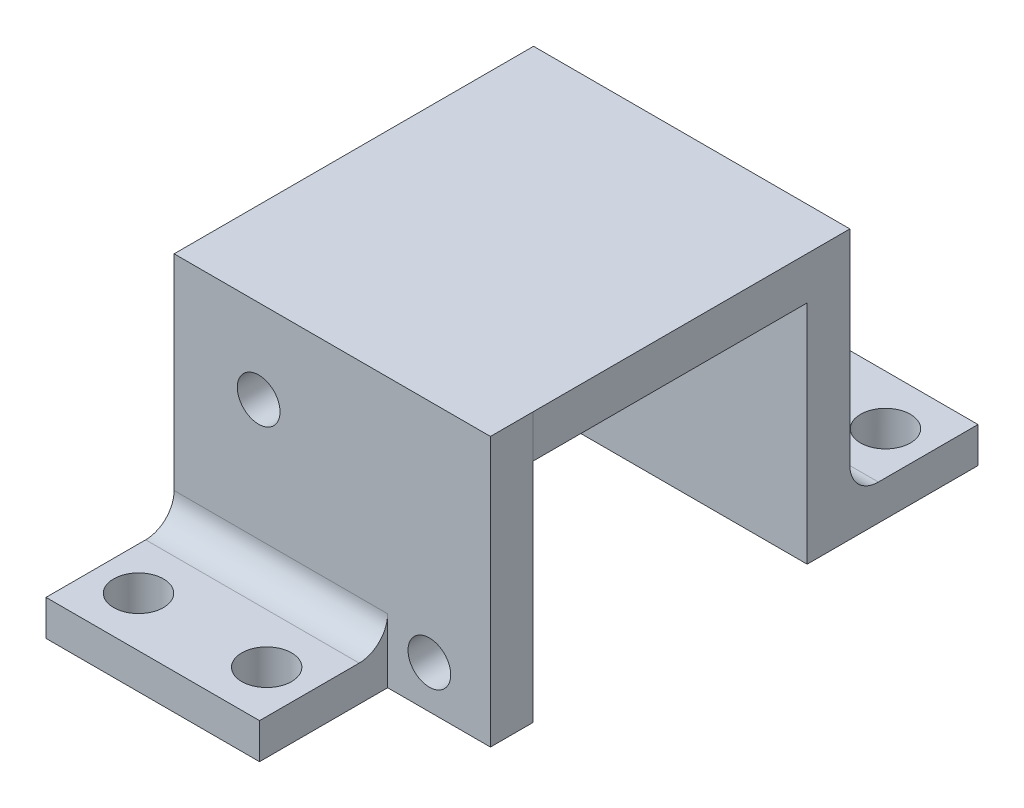
ISO-10303-21;
HEADER;
FILE_DESCRIPTION(('STEP AP214'),'2;1');
FILE_NAME('part.step','',(''),(''),'','','');
FILE_SCHEMA(('AUTOMOTIVE_DESIGN { 1 0 10303 214 1 1 1 1 }'));
ENDSEC;
DATA;
#1=APPLICATION_CONTEXT('core data for automotive mechanical design processes');
#2=APPLICATION_PROTOCOL_DEFINITION('international standard','automotive_design',2000,#1);
#3=PRODUCT_CONTEXT('',#1,'mechanical');
#4=PRODUCT('Part','Part','',(#3));
#5=PRODUCT_RELATED_PRODUCT_CATEGORY('part','',(#4));
#6=PRODUCT_DEFINITION_FORMATION('','',#4);
#7=PRODUCT_DEFINITION_CONTEXT('part definition',#1,'design');
#8=PRODUCT_DEFINITION('design','',#6,#7);
#9=PRODUCT_DEFINITION_SHAPE('','',#8);
#10=(LENGTH_UNIT() NAMED_UNIT(*) SI_UNIT(.MILLI.,.METRE.));
#11=(NAMED_UNIT(*) PLANE_ANGLE_UNIT() SI_UNIT($,.RADIAN.));
#12=(NAMED_UNIT(*) SI_UNIT($,.STERADIAN.) SOLID_ANGLE_UNIT());
#13=UNCERTAINTY_MEASURE_WITH_UNIT(LENGTH_MEASURE(1.E-05),#10,'distance_accuracy_value','');
#14=(GEOMETRIC_REPRESENTATION_CONTEXT(3) GLOBAL_UNCERTAINTY_ASSIGNED_CONTEXT((#13)) GLOBAL_UNIT_ASSIGNED_CONTEXT((#10,
#11,#12)) REPRESENTATION_CONTEXT('',''));
#15=CARTESIAN_POINT('',(0.,0.,0.));
#16=DIRECTION('',(0.,0.,1.));
#17=DIRECTION('',(1.,0.,0.));
#18=AXIS2_PLACEMENT_3D('',#15,#16,#17);
#19=CARTESIAN_POINT('',(0.,0.,0.));
#20=DIRECTION('',(0.,0.,1.));
#21=DIRECTION('',(1.,0.,0.));
#22=AXIS2_PLACEMENT_3D('',#19,#20,#21);
#23=PLANE('',#22);
#24=CARTESIAN_POINT('',(6.82,-4.95,0.));
#25=DIRECTION('',(0.,0.,1.));
#26=DIRECTION('',(1.,0.,0.));
#27=AXIS2_PLACEMENT_3D('',#24,#25,#26);
#28=CIRCLE('',#27,1.5);
#29=CARTESIAN_POINT('',(8.32,-4.95,0.));
#30=VERTEX_POINT('',#29);
#31=EDGE_CURVE('E419',#30,#30,#28,.T.);
#32=ORIENTED_EDGE('',*,*,#31,.T.);
#33=EDGE_LOOP('',(#32));
#34=FACE_BOUND('',#33,.T.);
#35=CARTESIAN_POINT('',(-5.17,5.05,0.));
#36=DIRECTION('',(0.,0.,1.));
#37=DIRECTION('',(1.,0.,0.));
#38=AXIS2_PLACEMENT_3D('',#35,#36,#37);
#39=CIRCLE('',#38,1.5);
#40=CARTESIAN_POINT('',(-3.67,5.05,0.));
#41=VERTEX_POINT('',#40);
#42=EDGE_CURVE('E412',#41,#41,#39,.T.);
#43=ORIENTED_EDGE('',*,*,#42,.T.);
#44=EDGE_LOOP('',(#43));
#45=FACE_BOUND('',#44,.T.);
#46=DIRECTION('',(-1.,0.,0.));
#47=VECTOR('',#46,1.);
#48=CARTESIAN_POINT('',(11.1100249999999,7.95,1.55161605272255E-13));
#49=LINE('',#48,#47);
#50=CARTESIAN_POINT('',(11.11,7.95,0.));
#51=VERTEX_POINT('',#50);
#52=CARTESIAN_POINT('',(-11.1099875,7.95,0.));
#53=VERTEX_POINT('',#52);
#54=EDGE_CURVE('E11',#51,#53,#49,.T.);
#55=ORIENTED_EDGE('',*,*,#54,.F.);
#56=DIRECTION('',(0.,1.,0.));
#57=VECTOR('',#56,1.);
#58=CARTESIAN_POINT('',(11.11,7.95,0.));
#59=LINE('',#58,#57);
#60=CARTESIAN_POINT('',(11.11,-7.95,0.));
#61=VERTEX_POINT('',#60);
#62=EDGE_CURVE('E277',#61,#51,#59,.T.);
#63=ORIENTED_EDGE('',*,*,#62,.F.);
#64=DIRECTION('',(1.,0.,0.));
#65=VECTOR('',#64,1.);
#66=CARTESIAN_POINT('',(-11.11,-7.95,0.));
#67=LINE('',#66,#65);
#68=CARTESIAN_POINT('',(-11.11,-7.95,0.));
#69=VERTEX_POINT('',#68);
#70=EDGE_CURVE('E276',#69,#61,#67,.T.);
#71=ORIENTED_EDGE('',*,*,#70,.F.);
#72=DIRECTION('',(0.,-1.,0.));
#73=VECTOR('',#72,1.);
#74=CARTESIAN_POINT('',(-11.11,7.95,0.));
#75=LINE('',#74,#73);
#76=EDGE_CURVE('E269',#53,#69,#75,.T.);
#77=ORIENTED_EDGE('',*,*,#76,.F.);
#78=EDGE_LOOP('',(#55,#63,#71,#77));
#79=FACE_BOUND('',#78,.T.);
#80=ADVANCED_FACE('F32',(#34,#45,#79),#23,.F.);
#81=CARTESIAN_POINT('',(0.,0.,3.));
#82=DIRECTION('',(0.,0.,1.));
#83=DIRECTION('',(1.,0.,0.));
#84=AXIS2_PLACEMENT_3D('',#81,#82,#83);
#85=PLANE('',#84);
#86=DIRECTION('',(0.,-1.,0.));
#87=VECTOR('',#86,1.);
#88=CARTESIAN_POINT('',(-11.11,7.95,3.));
#89=LINE('',#88,#87);
#90=CARTESIAN_POINT('',(-11.1099875000001,7.95,3.));
#91=VERTEX_POINT('',#90);
#92=CARTESIAN_POINT('',(-11.11,-3.44999999999999,3.));
#93=VERTEX_POINT('',#92);
#94=EDGE_CURVE('E423',#91,#93,#89,.T.);
#95=ORIENTED_EDGE('',*,*,#94,.T.);
#96=DIRECTION('',(-1.,0.,0.));
#97=VECTOR('',#96,1.);
#98=CARTESIAN_POINT('',(3.89,-3.44999999999999,3.));
#99=LINE('',#98,#97);
#100=CARTESIAN_POINT('',(3.89,-3.44999999999999,3.));
#101=VERTEX_POINT('',#100);
#102=EDGE_CURVE('E506',#93,#101,#99,.F.);
#103=ORIENTED_EDGE('',*,*,#102,.T.);
#104=DIRECTION('',(0.,-1.,0.));
#105=VECTOR('',#104,1.);
#106=CARTESIAN_POINT('',(3.89,-5.44999999999999,3.));
#107=LINE('',#106,#105);
#108=CARTESIAN_POINT('',(3.89,-7.95,3.));
#109=VERTEX_POINT('',#108);
#110=EDGE_CURVE('E55',#101,#109,#107,.T.);
#111=ORIENTED_EDGE('',*,*,#110,.T.);
#112=DIRECTION('',(1.,0.,0.));
#113=VECTOR('',#112,1.);
#114=CARTESIAN_POINT('',(-11.11,-7.95,3.));
#115=LINE('',#114,#113);
#116=CARTESIAN_POINT('',(11.11,-7.95,3.));
#117=VERTEX_POINT('',#116);
#118=EDGE_CURVE('E431',#109,#117,#115,.T.);
#119=ORIENTED_EDGE('',*,*,#118,.T.);
#120=DIRECTION('',(0.,1.,0.));
#121=VECTOR('',#120,1.);
#122=CARTESIAN_POINT('',(11.11,7.95,3.));
#123=LINE('',#122,#121);
#124=CARTESIAN_POINT('',(11.11,10.95,3.00000000000016));
#125=VERTEX_POINT('',#124);
#126=EDGE_CURVE('E409',#117,#125,#123,.T.);
#127=ORIENTED_EDGE('',*,*,#126,.T.);
#128=DIRECTION('',(-1.,0.,0.));
#129=VECTOR('',#128,1.);
#130=CARTESIAN_POINT('',(11.11,10.95,3.00000000000016));
#131=LINE('',#130,#129);
#132=CARTESIAN_POINT('',(-11.1099750000001,10.95,3.));
#133=VERTEX_POINT('',#132);
#134=EDGE_CURVE('E189',#125,#133,#131,.T.);
#135=ORIENTED_EDGE('',*,*,#134,.T.);
#136=DIRECTION('',(0.,1.,0.));
#137=VECTOR('',#136,1.);
#138=CARTESIAN_POINT('',(-11.1099750000001,7.95,3.));
#139=LINE('',#138,#137);
#140=EDGE_CURVE('E188',#91,#133,#139,.T.);
#141=ORIENTED_EDGE('',*,*,#140,.F.);
#142=EDGE_LOOP('',(#95,#103,#111,#119,#127,#135,#141));
#143=FACE_BOUND('',#142,.T.);
#144=CARTESIAN_POINT('',(-5.17,5.05,3.));
#145=DIRECTION('',(0.,0.,1.));
#146=DIRECTION('',(1.,0.,0.));
#147=AXIS2_PLACEMENT_3D('',#144,#145,#146);
#148=CIRCLE('',#147,1.5);
#149=CARTESIAN_POINT('',(-3.67,5.05,3.));
#150=VERTEX_POINT('',#149);
#151=EDGE_CURVE('E410',#150,#150,#148,.T.);
#152=ORIENTED_EDGE('',*,*,#151,.F.);
#153=EDGE_LOOP('',(#152));
#154=FACE_BOUND('',#153,.T.);
#155=CARTESIAN_POINT('',(6.82,-4.95,3.));
#156=DIRECTION('',(0.,0.,1.));
#157=DIRECTION('',(1.,0.,0.));
#158=AXIS2_PLACEMENT_3D('',#155,#156,#157);
#159=CIRCLE('',#158,1.5);
#160=CARTESIAN_POINT('',(8.32,-4.95,3.));
#161=VERTEX_POINT('',#160);
#162=EDGE_CURVE('E416',#161,#161,#159,.T.);
#163=ORIENTED_EDGE('',*,*,#162,.F.);
#164=EDGE_LOOP('',(#163));
#165=FACE_BOUND('',#164,.T.);
#166=ADVANCED_FACE('F248',(#143,#154,#165),#85,.T.);
#167=CARTESIAN_POINT('',(11.11,7.95,3.));
#168=DIRECTION('',(-1.,0.,0.));
#169=DIRECTION('',(0.,-1.,0.));
#170=AXIS2_PLACEMENT_3D('',#167,#168,#169);
#171=PLANE('',#170);
#172=ORIENTED_EDGE('',*,*,#62,.T.);
#173=CARTESIAN_POINT('',(11.11,10.95,0.));
#174=VERTEX_POINT('',#173);
#175=EDGE_CURVE('E171',#51,#174,#59,.T.);
#176=ORIENTED_EDGE('',*,*,#175,.T.);
#177=DIRECTION('',(0.,0.,-1.));
#178=VECTOR('',#177,1.);
#179=CARTESIAN_POINT('',(11.11,10.95,3.00000000000016));
#180=LINE('',#179,#178);
#181=EDGE_CURVE('E187',#125,#174,#180,.T.);
#182=ORIENTED_EDGE('',*,*,#181,.F.);
#183=ORIENTED_EDGE('',*,*,#126,.F.);
#184=DIRECTION('',(0.,0.,-1.));
#185=VECTOR('',#184,1.);
#186=CARTESIAN_POINT('',(11.11,-7.95,3.));
#187=LINE('',#186,#185);
#188=EDGE_CURVE('E435',#117,#61,#187,.T.);
#189=ORIENTED_EDGE('',*,*,#188,.T.);
#190=EDGE_LOOP('',(#172,#176,#182,#183,#189));
#191=FACE_BOUND('',#190,.T.);
#192=ADVANCED_FACE('F251',(#191),#171,.F.);
#193=CARTESIAN_POINT('',(-11.11,7.95,3.));
#194=DIRECTION('',(1.,0.,0.));
#195=DIRECTION('',(0.,1.,0.));
#196=AXIS2_PLACEMENT_3D('',#193,#194,#195);
#197=PLANE('',#196);
#198=ORIENTED_EDGE('',*,*,#76,.T.);
#199=DIRECTION('',(0.,0.,-1.));
#200=VECTOR('',#199,1.);
#201=CARTESIAN_POINT('',(-11.11,-7.95,3.));
#202=LINE('',#201,#200);
#203=CARTESIAN_POINT('',(-11.11,-7.95,12.));
#204=VERTEX_POINT('',#203);
#205=EDGE_CURVE('E432',#204,#69,#202,.T.);
#206=ORIENTED_EDGE('',*,*,#205,.F.);
#207=DIRECTION('',(0.,1.,0.));
#208=VECTOR('',#207,1.);
#209=CARTESIAN_POINT('',(-11.11,-5.45,12.));
#210=LINE('',#209,#208);
#211=CARTESIAN_POINT('',(-11.11,-5.45,12.));
#212=VERTEX_POINT('',#211);
#213=EDGE_CURVE('E451',#204,#212,#210,.T.);
#214=ORIENTED_EDGE('',*,*,#213,.T.);
#215=DIRECTION('',(0.,0.,-1.));
#216=VECTOR('',#215,1.);
#217=CARTESIAN_POINT('',(-11.11,-5.45,12.));
#218=LINE('',#217,#216);
#219=CARTESIAN_POINT('',(-11.11,-5.45,5.));
#220=VERTEX_POINT('',#219);
#221=EDGE_CURVE('E445',#212,#220,#218,.T.);
#222=ORIENTED_EDGE('',*,*,#221,.T.);
#223=CARTESIAN_POINT('',(-11.11,-3.45,5.));
#224=DIRECTION('',(1.,0.,0.));
#225=DIRECTION('',(0.,1.,0.));
#226=AXIS2_PLACEMENT_3D('',#223,#224,#225);
#227=CIRCLE('',#226,2.);
#228=EDGE_CURVE('E505',#220,#93,#227,.T.);
#229=ORIENTED_EDGE('',*,*,#228,.T.);
#230=ORIENTED_EDGE('',*,*,#94,.F.);
#231=CARTESIAN_POINT('',(-11.11,7.95,3.));
#232=DIRECTION('',(0.,0.,-1.));
#233=VECTOR('',#232,1.);
#234=LINE('',#231,#233);
#235=EDGE_CURVE('E198',#91,#53,#234,.T.);
#236=ORIENTED_EDGE('',*,*,#235,.T.);
#237=EDGE_LOOP('',(#198,#206,#214,#222,#229,#230,#236));
#238=FACE_BOUND('',#237,.T.);
#239=ADVANCED_FACE('F258',(#238),#197,.F.);
#240=CARTESIAN_POINT('',(-11.11,-7.95,3.));
#241=DIRECTION('',(0.,1.,0.));
#242=DIRECTION('',(0.,0.,1.));
#243=AXIS2_PLACEMENT_3D('',#240,#241,#242);
#244=PLANE('',#243);
#245=CARTESIAN_POINT('',(0.890000000000004,-7.95,8.5));
#246=DIRECTION('',(0.,1.,0.));
#247=DIRECTION('',(0.,0.,1.));
#248=AXIS2_PLACEMENT_3D('',#245,#246,#247);
#249=CIRCLE('',#248,1.75);
#250=CARTESIAN_POINT('',(0.890000000000004,-7.95,10.25));
#251=VERTEX_POINT('',#250);
#252=EDGE_CURVE('E489',#251,#251,#249,.F.);
#253=ORIENTED_EDGE('',*,*,#252,.F.);
#254=EDGE_LOOP('',(#253));
#255=FACE_BOUND('',#254,.T.);
#256=CARTESIAN_POINT('',(-8.11,-7.95,8.5));
#257=DIRECTION('',(0.,1.,0.));
#258=DIRECTION('',(0.,0.,1.));
#259=AXIS2_PLACEMENT_3D('',#256,#257,#258);
#260=CIRCLE('',#259,1.75);
#261=CARTESIAN_POINT('',(-8.11,-7.95,10.25));
#262=VERTEX_POINT('',#261);
#263=EDGE_CURVE('E454',#262,#262,#260,.F.);
#264=ORIENTED_EDGE('',*,*,#263,.F.);
#265=EDGE_LOOP('',(#264));
#266=FACE_BOUND('',#265,.T.);
#267=ORIENTED_EDGE('',*,*,#70,.T.);
#268=ORIENTED_EDGE('',*,*,#188,.F.);
#269=ORIENTED_EDGE('',*,*,#118,.F.);
#270=DIRECTION('',(0.,0.,1.));
#271=VECTOR('',#270,1.);
#272=CARTESIAN_POINT('',(3.89,-7.94999999999999,12.));
#273=LINE('',#272,#271);
#274=CARTESIAN_POINT('',(3.89,-7.94999999999999,12.));
#275=VERTEX_POINT('',#274);
#276=EDGE_CURVE('E436',#109,#275,#273,.T.);
#277=ORIENTED_EDGE('',*,*,#276,.T.);
#278=DIRECTION('',(-1.,0.,0.));
#279=VECTOR('',#278,1.);
#280=CARTESIAN_POINT('',(3.89,-7.94999999999999,12.));
#281=LINE('',#280,#279);
#282=EDGE_CURVE('E455',#275,#204,#281,.T.);
#283=ORIENTED_EDGE('',*,*,#282,.T.);
#284=ORIENTED_EDGE('',*,*,#205,.T.);
#285=EDGE_LOOP('',(#267,#268,#269,#277,#283,#284));
#286=FACE_BOUND('',#285,.T.);
#287=ADVANCED_FACE('F246',(#255,#266,#286),#244,.F.);
#288=CARTESIAN_POINT('',(-5.17,5.05,3.));
#289=DIRECTION('',(0.,0.,-1.));
#290=DIRECTION('',(-1.,0.,0.));
#291=AXIS2_PLACEMENT_3D('',#288,#289,#290);
#292=CYLINDRICAL_SURFACE('',#291,1.5);
#293=ORIENTED_EDGE('',*,*,#151,.T.);
#294=EDGE_LOOP('',(#293));
#295=FACE_BOUND('',#294,.T.);
#296=ORIENTED_EDGE('',*,*,#42,.F.);
#297=EDGE_LOOP('',(#296));
#298=FACE_BOUND('',#297,.T.);
#299=ADVANCED_FACE('F242',(#295,#298),#292,.F.);
#300=CARTESIAN_POINT('',(6.82,-4.95,3.));
#301=DIRECTION('',(0.,0.,-1.));
#302=DIRECTION('',(-1.,0.,0.));
#303=AXIS2_PLACEMENT_3D('',#300,#301,#302);
#304=CYLINDRICAL_SURFACE('',#303,1.5);
#305=ORIENTED_EDGE('',*,*,#162,.T.);
#306=EDGE_LOOP('',(#305));
#307=FACE_BOUND('',#306,.T.);
#308=ORIENTED_EDGE('',*,*,#31,.F.);
#309=EDGE_LOOP('',(#308));
#310=FACE_BOUND('',#309,.T.);
#311=ADVANCED_FACE('F238',(#307,#310),#304,.F.);
#312=CARTESIAN_POINT('',(3.89,-5.44999999999999,12.));
#313=DIRECTION('',(0.,0.,1.));
#314=DIRECTION('',(1.,0.,0.));
#315=AXIS2_PLACEMENT_3D('',#312,#313,#314);
#316=PLANE('',#315);
#317=ORIENTED_EDGE('',*,*,#213,.F.);
#318=ORIENTED_EDGE('',*,*,#282,.F.);
#319=DIRECTION('',(0.,1.,0.));
#320=VECTOR('',#319,1.);
#321=CARTESIAN_POINT('',(3.89,-5.44999999999999,12.));
#322=LINE('',#321,#320);
#323=CARTESIAN_POINT('',(3.89,-5.44999999999999,12.));
#324=VERTEX_POINT('',#323);
#325=EDGE_CURVE('E471',#275,#324,#322,.T.);
#326=ORIENTED_EDGE('',*,*,#325,.T.);
#327=DIRECTION('',(-1.,0.,0.));
#328=VECTOR('',#327,1.);
#329=CARTESIAN_POINT('',(3.89,-5.44999999999999,12.));
#330=LINE('',#329,#328);
#331=EDGE_CURVE('E439',#324,#212,#330,.T.);
#332=ORIENTED_EDGE('',*,*,#331,.T.);
#333=EDGE_LOOP('',(#317,#318,#326,#332));
#334=FACE_BOUND('',#333,.T.);
#335=ADVANCED_FACE('F234',(#334),#316,.T.);
#336=CARTESIAN_POINT('',(3.89,-5.44999999999999,12.));
#337=DIRECTION('',(0.,1.,0.));
#338=DIRECTION('',(-1.,0.,0.));
#339=AXIS2_PLACEMENT_3D('',#336,#337,#338);
#340=PLANE('',#339);
#341=CARTESIAN_POINT('',(0.890000000000004,-5.44999999999999,8.5));
#342=DIRECTION('',(0.,1.,0.));
#343=DIRECTION('',(1.,0.,0.));
#344=AXIS2_PLACEMENT_3D('',#341,#342,#343);
#345=CIRCLE('',#344,1.75);
#346=CARTESIAN_POINT('',(2.64,-5.44999999999999,8.5));
#347=VERTEX_POINT('',#346);
#348=EDGE_CURVE('E191',#347,#347,#345,.T.);
#349=ORIENTED_EDGE('',*,*,#348,.F.);
#350=EDGE_LOOP('',(#349));
#351=FACE_BOUND('',#350,.T.);
#352=CARTESIAN_POINT('',(-8.11,-5.44999999999999,8.5));
#353=DIRECTION('',(0.,1.,0.));
#354=DIRECTION('',(-1.,0.,0.));
#355=AXIS2_PLACEMENT_3D('',#352,#353,#354);
#356=CIRCLE('',#355,1.75);
#357=CARTESIAN_POINT('',(-9.86,-5.44999999999999,8.5));
#358=VERTEX_POINT('',#357);
#359=EDGE_CURVE('E486',#358,#358,#356,.T.);
#360=ORIENTED_EDGE('',*,*,#359,.F.);
#361=EDGE_LOOP('',(#360));
#362=FACE_BOUND('',#361,.T.);
#363=DIRECTION('',(0.,0.,-1.));
#364=VECTOR('',#363,1.);
#365=CARTESIAN_POINT('',(3.89,-5.44999999999999,12.));
#366=LINE('',#365,#364);
#367=CARTESIAN_POINT('',(3.89,-5.44999999999999,5.));
#368=VERTEX_POINT('',#367);
#369=EDGE_CURVE('E444',#324,#368,#366,.T.);
#370=ORIENTED_EDGE('',*,*,#369,.T.);
#371=DIRECTION('',(-1.,0.,0.));
#372=VECTOR('',#371,1.);
#373=CARTESIAN_POINT('',(-11.11,-5.45,5.));
#374=LINE('',#373,#372);
#375=EDGE_CURVE('E478',#368,#220,#374,.T.);
#376=ORIENTED_EDGE('',*,*,#375,.T.);
#377=ORIENTED_EDGE('',*,*,#221,.F.);
#378=ORIENTED_EDGE('',*,*,#331,.F.);
#379=EDGE_LOOP('',(#370,#376,#377,#378));
#380=FACE_BOUND('',#379,.T.);
#381=ADVANCED_FACE('F231',(#351,#362,#380),#340,.T.);
#382=CARTESIAN_POINT('',(3.89,0.,0.));
#383=DIRECTION('',(1.,0.,0.));
#384=DIRECTION('',(0.,0.,-1.));
#385=AXIS2_PLACEMENT_3D('',#382,#383,#384);
#386=PLANE('',#385);
#387=ORIENTED_EDGE('',*,*,#325,.F.);
#388=ORIENTED_EDGE('',*,*,#276,.F.);
#389=ORIENTED_EDGE('',*,*,#110,.F.);
#390=CARTESIAN_POINT('',(3.89,-3.44999999999999,5.));
#391=DIRECTION('',(1.,0.,0.));
#392=DIRECTION('',(0.,0.,-1.));
#393=AXIS2_PLACEMENT_3D('',#390,#391,#392);
#394=CIRCLE('',#393,2.);
#395=EDGE_CURVE('E41',#101,#368,#394,.F.);
#396=ORIENTED_EDGE('',*,*,#395,.T.);
#397=ORIENTED_EDGE('',*,*,#369,.F.);
#398=EDGE_LOOP('',(#387,#388,#389,#396,#397));
#399=FACE_BOUND('',#398,.T.);
#400=ADVANCED_FACE('F228',(#399),#386,.T.);
#401=CARTESIAN_POINT('',(3.89,-3.44999999999999,5.));
#402=DIRECTION('',(1.,0.,0.));
#403=DIRECTION('',(0.,1.,0.));
#404=AXIS2_PLACEMENT_3D('',#401,#402,#403);
#405=CYLINDRICAL_SURFACE('',#404,2.);
#406=ORIENTED_EDGE('',*,*,#395,.F.);
#407=ORIENTED_EDGE('',*,*,#102,.F.);
#408=ORIENTED_EDGE('',*,*,#228,.F.);
#409=ORIENTED_EDGE('',*,*,#375,.F.);
#410=EDGE_LOOP('',(#406,#407,#408,#409));
#411=FACE_BOUND('',#410,.T.);
#412=ADVANCED_FACE('F34',(#411),#405,.F.);
#413=CARTESIAN_POINT('',(-8.11,-7.95105,8.5));
#414=DIRECTION('',(0.,1.,0.));
#415=DIRECTION('',(-1.,0.,0.));
#416=AXIS2_PLACEMENT_3D('',#413,#414,#415);
#417=CYLINDRICAL_SURFACE('',#416,1.75);
#418=ORIENTED_EDGE('',*,*,#359,.T.);
#419=EDGE_LOOP('',(#418));
#420=FACE_BOUND('',#419,.T.);
#421=ORIENTED_EDGE('',*,*,#263,.T.);
#422=EDGE_LOOP('',(#421));
#423=FACE_BOUND('',#422,.T.);
#424=ADVANCED_FACE('F223',(#420,#423),#417,.F.);
#425=CARTESIAN_POINT('',(0.890000000000004,-7.95105,8.5));
#426=DIRECTION('',(0.,1.,0.));
#427=DIRECTION('',(-1.,0.,0.));
#428=AXIS2_PLACEMENT_3D('',#425,#426,#427);
#429=CYLINDRICAL_SURFACE('',#428,1.75);
#430=ORIENTED_EDGE('',*,*,#348,.T.);
#431=EDGE_LOOP('',(#430));
#432=FACE_BOUND('',#431,.T.);
#433=ORIENTED_EDGE('',*,*,#252,.T.);
#434=EDGE_LOOP('',(#433));
#435=FACE_BOUND('',#434,.T.);
#436=ADVANCED_FACE('F219',(#432,#435),#429,.F.);
#437=CARTESIAN_POINT('',(11.11,10.95,3.00000000000016));
#438=DIRECTION('',(0.,1.,0.));
#439=DIRECTION('',(-1.,0.,0.));
#440=AXIS2_PLACEMENT_3D('',#437,#438,#439);
#441=PLANE('',#440);
#442=DIRECTION('',(0.,0.,-1.));
#443=VECTOR('',#442,1.);
#444=CARTESIAN_POINT('',(-11.1099750000001,10.95,3.));
#445=LINE('',#444,#443);
#446=CARTESIAN_POINT('',(-11.1099749999999,10.95,-22.2499750000001));
#447=VERTEX_POINT('',#446);
#448=EDGE_CURVE('E185',#133,#447,#445,.T.);
#449=ORIENTED_EDGE('',*,*,#448,.F.);
#450=ORIENTED_EDGE('',*,*,#134,.F.);
#451=ORIENTED_EDGE('',*,*,#181,.T.);
#452=DIRECTION('',(0.,0.,-1.));
#453=VECTOR('',#452,1.);
#454=CARTESIAN_POINT('',(11.1100249999999,10.95,0.));
#455=LINE('',#454,#453);
#456=CARTESIAN_POINT('',(11.1100250000001,10.95,-22.2499749999999));
#457=VERTEX_POINT('',#456);
#458=EDGE_CURVE('E173',#174,#457,#455,.T.);
#459=ORIENTED_EDGE('',*,*,#458,.T.);
#460=DIRECTION('',(-1.,0.,0.));
#461=VECTOR('',#460,1.);
#462=CARTESIAN_POINT('',(11.1100250000001,10.95,-22.2499749999999));
#463=LINE('',#462,#461);
#464=EDGE_CURVE('E172',#457,#447,#463,.T.);
#465=ORIENTED_EDGE('',*,*,#464,.T.);
#466=EDGE_LOOP('',(#449,#450,#451,#459,#465));
#467=FACE_BOUND('',#466,.T.);
#468=ADVANCED_FACE('F214',(#467),#441,.T.);
#469=CARTESIAN_POINT('',(-11.1099750000001,0.,0.));
#470=DIRECTION('',(-1.,0.,0.));
#471=DIRECTION('',(0.,0.,1.));
#472=AXIS2_PLACEMENT_3D('',#469,#470,#471);
#473=PLANE('',#472);
#474=ORIENTED_EDGE('',*,*,#448,.T.);
#475=DIRECTION('',(0.,1.,0.));
#476=VECTOR('',#475,1.);
#477=CARTESIAN_POINT('',(-11.1099749999999,7.95,-22.2499750000001));
#478=LINE('',#477,#476);
#479=CARTESIAN_POINT('',(-11.1099749999999,-7.95,-22.2499750000001));
#480=VERTEX_POINT('',#479);
#481=EDGE_CURVE('E350',#480,#447,#478,.T.);
#482=ORIENTED_EDGE('',*,*,#481,.F.);
#483=DIRECTION('',(0.,0.,1.));
#484=VECTOR('',#483,1.);
#485=CARTESIAN_POINT('',(-11.1099749999999,-7.95,-22.2499750000001));
#486=LINE('',#485,#484);
#487=CARTESIAN_POINT('',(-11.109975,-7.95,-19.2499750000001));
#488=VERTEX_POINT('',#487);
#489=EDGE_CURVE('E351',#480,#488,#486,.T.);
#490=ORIENTED_EDGE('',*,*,#489,.T.);
#491=DIRECTION('',(0.,1.,0.));
#492=VECTOR('',#491,1.);
#493=CARTESIAN_POINT('',(-11.109975,7.95,-19.2499750000001));
#494=LINE('',#493,#492);
#495=CARTESIAN_POINT('',(-11.109975,7.95,-19.2499750000001));
#496=VERTEX_POINT('',#495);
#497=EDGE_CURVE('E342',#488,#496,#494,.T.);
#498=ORIENTED_EDGE('',*,*,#497,.T.);
#499=DIRECTION('',(0.,0.,1.));
#500=VECTOR('',#499,1.);
#501=CARTESIAN_POINT('',(-11.1099749999999,7.95,-22.2499750000001));
#502=LINE('',#501,#500);
#503=EDGE_CURVE('E165',#496,#53,#502,.T.);
#504=ORIENTED_EDGE('',*,*,#503,.T.);
#505=ORIENTED_EDGE('',*,*,#235,.F.);
#506=ORIENTED_EDGE('',*,*,#140,.T.);
#507=EDGE_LOOP('',(#474,#482,#490,#498,#504,#505,#506));
#508=FACE_BOUND('',#507,.T.);
#509=ADVANCED_FACE('F204',(#508),#473,.T.);
#510=CARTESIAN_POINT('',(11.1100249999999,7.95,1.55161605272255E-13));
#511=DIRECTION('',(0.,0.,1.));
#512=DIRECTION('',(0.,-1.,0.));
#513=AXIS2_PLACEMENT_3D('',#510,#511,#512);
#514=PLANE('',#513);
#515=ORIENTED_EDGE('',*,*,#175,.F.);
#516=CARTESIAN_POINT('',(11.1100249999999,7.95,1.55161605272255E-13));
#517=VERTEX_POINT('',#516);
#518=EDGE_CURVE('E160',#517,#51,#49,.T.);
#519=ORIENTED_EDGE('',*,*,#518,.F.);
#520=DIRECTION('',(0.,1.,0.));
#521=VECTOR('',#520,1.);
#522=CARTESIAN_POINT('',(11.1100249999999,7.95,1.55161605272255E-13));
#523=LINE('',#522,#521);
#524=EDGE_CURVE('E164',#517,#174,#523,.T.);
#525=ORIENTED_EDGE('',*,*,#524,.T.);
#526=EDGE_LOOP('',(#515,#519,#525));
#527=FACE_BOUND('',#526,.T.);
#528=ADVANCED_FACE('F170',(#527),#514,.T.);
#529=CARTESIAN_POINT('',(2.50000000628782E-05,0.,-22.249975));
#530=DIRECTION('',(0.,0.,-1.));
#531=DIRECTION('',(-1.,0.,0.));
#532=AXIS2_PLACEMENT_3D('',#529,#530,#531);
#533=PLANE('',#532);
#534=DIRECTION('',(0.,-1.,0.));
#535=VECTOR('',#534,1.);
#536=CARTESIAN_POINT('',(11.1100250000001,7.95,-22.2499749999999));
#537=LINE('',#536,#535);
#538=CARTESIAN_POINT('',(11.1100250000001,-3.44999999999999,-22.2499749999999));
#539=VERTEX_POINT('',#538);
#540=EDGE_CURVE('E357',#457,#539,#537,.T.);
#541=ORIENTED_EDGE('',*,*,#540,.T.);
#542=DIRECTION('',(1.,0.,0.));
#543=VECTOR('',#542,1.);
#544=CARTESIAN_POINT('',(-3.88997499999994,-3.44999999999999,-22.249975));
#545=LINE('',#544,#543);
#546=CARTESIAN_POINT('',(-3.88997499999994,-3.44999999999999,-22.249975));
#547=VERTEX_POINT('',#546);
#548=EDGE_CURVE('E327',#539,#547,#545,.F.);
#549=ORIENTED_EDGE('',*,*,#548,.T.);
#550=DIRECTION('',(0.,-1.,0.));
#551=VECTOR('',#550,1.);
#552=CARTESIAN_POINT('',(-3.88997499999994,-5.44999999999999,-22.249975));
#553=LINE('',#552,#551);
#554=CARTESIAN_POINT('',(-3.88997499999994,-7.95,-22.249975));
#555=VERTEX_POINT('',#554);
#556=EDGE_CURVE('E309',#547,#555,#553,.T.);
#557=ORIENTED_EDGE('',*,*,#556,.T.);
#558=DIRECTION('',(-1.,0.,0.));
#559=VECTOR('',#558,1.);
#560=CARTESIAN_POINT('',(11.1100250000001,-7.95,-22.2499749999999));
#561=LINE('',#560,#559);
#562=EDGE_CURVE('E354',#555,#480,#561,.T.);
#563=ORIENTED_EDGE('',*,*,#562,.T.);
#564=ORIENTED_EDGE('',*,*,#481,.T.);
#565=ORIENTED_EDGE('',*,*,#464,.F.);
#566=EDGE_LOOP('',(#541,#549,#557,#563,#564,#565));
#567=FACE_BOUND('',#566,.T.);
#568=CARTESIAN_POINT('',(5.17002500000006,5.05,-22.249975));
#569=DIRECTION('',(0.,0.,-1.));
#570=DIRECTION('',(-1.,0.,0.));
#571=AXIS2_PLACEMENT_3D('',#568,#569,#570);
#572=CIRCLE('',#571,1.5);
#573=CARTESIAN_POINT('',(3.67002500000006,5.05,-22.249975));
#574=VERTEX_POINT('',#573);
#575=EDGE_CURVE('E367',#574,#574,#572,.T.);
#576=ORIENTED_EDGE('',*,*,#575,.F.);
#577=EDGE_LOOP('',(#576));
#578=FACE_BOUND('',#577,.T.);
#579=CARTESIAN_POINT('',(-6.81997499999994,-4.95,-22.249975));
#580=DIRECTION('',(0.,0.,-1.));
#581=DIRECTION('',(-1.,0.,0.));
#582=AXIS2_PLACEMENT_3D('',#579,#580,#581);
#583=CIRCLE('',#582,1.5);
#584=CARTESIAN_POINT('',(-8.31997499999994,-4.95,-22.2499750000001));
#585=VERTEX_POINT('',#584);
#586=EDGE_CURVE('E368',#585,#585,#583,.T.);
#587=ORIENTED_EDGE('',*,*,#586,.F.);
#588=EDGE_LOOP('',(#587));
#589=FACE_BOUND('',#588,.T.);
#590=ADVANCED_FACE('F401',(#567,#578,#589),#533,.T.);
#591=CARTESIAN_POINT('',(2.50000000419293E-05,0.,-19.249975));
#592=DIRECTION('',(0.,0.,-1.));
#593=DIRECTION('',(-1.,0.,0.));
#594=AXIS2_PLACEMENT_3D('',#591,#592,#593);
#595=PLANE('',#594);
#596=CARTESIAN_POINT('',(5.17002500000004,5.05,-19.249975));
#597=DIRECTION('',(0.,0.,-1.));
#598=DIRECTION('',(-1.,0.,0.));
#599=AXIS2_PLACEMENT_3D('',#596,#597,#598);
#600=CIRCLE('',#599,1.5);
#601=CARTESIAN_POINT('',(3.67002500000004,5.05,-19.249975));
#602=VERTEX_POINT('',#601);
#603=EDGE_CURVE('E364',#602,#602,#600,.T.);
#604=ORIENTED_EDGE('',*,*,#603,.T.);
#605=EDGE_LOOP('',(#604));
#606=FACE_BOUND('',#605,.T.);
#607=ORIENTED_EDGE('',*,*,#497,.F.);
#608=DIRECTION('',(-1.,0.,0.));
#609=VECTOR('',#608,1.);
#610=CARTESIAN_POINT('',(11.110025,-7.95,-19.2499749999999));
#611=LINE('',#610,#609);
#612=CARTESIAN_POINT('',(11.110025,-7.95,-19.2499749999999));
#613=VERTEX_POINT('',#612);
#614=EDGE_CURVE('E337',#613,#488,#611,.T.);
#615=ORIENTED_EDGE('',*,*,#614,.F.);
#616=DIRECTION('',(0.,-1.,0.));
#617=VECTOR('',#616,1.);
#618=CARTESIAN_POINT('',(11.110025,7.95,-19.2499749999999));
#619=LINE('',#618,#617);
#620=CARTESIAN_POINT('',(11.110025,7.95,-19.249975));
#621=VERTEX_POINT('',#620);
#622=EDGE_CURVE('E335',#621,#613,#619,.T.);
#623=ORIENTED_EDGE('',*,*,#622,.F.);
#624=DIRECTION('',(1.,0.,0.));
#625=VECTOR('',#624,1.);
#626=CARTESIAN_POINT('',(11.110025,7.95,-19.2499749999999));
#627=LINE('',#626,#625);
#628=EDGE_CURVE('E161',#496,#621,#627,.T.);
#629=ORIENTED_EDGE('',*,*,#628,.F.);
#630=EDGE_LOOP('',(#607,#615,#623,#629));
#631=FACE_BOUND('',#630,.T.);
#632=CARTESIAN_POINT('',(-6.81997499999996,-4.95,-19.2499750000001));
#633=DIRECTION('',(0.,0.,-1.));
#634=DIRECTION('',(-1.,0.,0.));
#635=AXIS2_PLACEMENT_3D('',#632,#633,#634);
#636=CIRCLE('',#635,1.5);
#637=CARTESIAN_POINT('',(-8.31997499999996,-4.95,-19.2499750000001));
#638=VERTEX_POINT('',#637);
#639=EDGE_CURVE('E371',#638,#638,#636,.T.);
#640=ORIENTED_EDGE('',*,*,#639,.T.);
#641=EDGE_LOOP('',(#640));
#642=FACE_BOUND('',#641,.T.);
#643=ADVANCED_FACE('F392',(#606,#631,#642),#595,.F.);
#644=CARTESIAN_POINT('',(11.1100250000001,7.95,-22.2499749999999));
#645=DIRECTION('',(-1.,0.,0.));
#646=DIRECTION('',(0.,1.,0.));
#647=AXIS2_PLACEMENT_3D('',#644,#645,#646);
#648=PLANE('',#647);
#649=ORIENTED_EDGE('',*,*,#622,.T.);
#650=DIRECTION('',(0.,0.,1.));
#651=VECTOR('',#650,1.);
#652=CARTESIAN_POINT('',(11.1100250000001,-7.95,-22.2499749999999));
#653=LINE('',#652,#651);
#654=CARTESIAN_POINT('',(11.1100250000001,-7.95,-31.2499749999999));
#655=VERTEX_POINT('',#654);
#656=EDGE_CURVE('E328',#655,#613,#653,.T.);
#657=ORIENTED_EDGE('',*,*,#656,.F.);
#658=DIRECTION('',(0.,1.,0.));
#659=VECTOR('',#658,1.);
#660=CARTESIAN_POINT('',(11.1100250000001,-5.45,-31.2499749999999));
#661=LINE('',#660,#659);
#662=CARTESIAN_POINT('',(11.1100250000001,-5.45,-31.2499749999999));
#663=VERTEX_POINT('',#662);
#664=EDGE_CURVE('E301',#655,#663,#661,.T.);
#665=ORIENTED_EDGE('',*,*,#664,.T.);
#666=DIRECTION('',(0.,0.,1.));
#667=VECTOR('',#666,1.);
#668=CARTESIAN_POINT('',(11.1100250000001,-5.45,-31.2499749999999));
#669=LINE('',#668,#667);
#670=CARTESIAN_POINT('',(11.1100250000001,-5.45,-24.2499749999999));
#671=VERTEX_POINT('',#670);
#672=EDGE_CURVE('E306',#663,#671,#669,.T.);
#673=ORIENTED_EDGE('',*,*,#672,.T.);
#674=CARTESIAN_POINT('',(11.1100250000001,-3.45,-24.2499749999999));
#675=DIRECTION('',(-1.,0.,0.));
#676=DIRECTION('',(0.,1.,0.));
#677=AXIS2_PLACEMENT_3D('',#674,#675,#676);
#678=CIRCLE('',#677,2.);
#679=EDGE_CURVE('E331',#671,#539,#678,.T.);
#680=ORIENTED_EDGE('',*,*,#679,.T.);
#681=ORIENTED_EDGE('',*,*,#540,.F.);
#682=ORIENTED_EDGE('',*,*,#458,.F.);
#683=ORIENTED_EDGE('',*,*,#524,.F.);
#684=DIRECTION('',(0.,0.,1.));
#685=VECTOR('',#684,1.);
#686=CARTESIAN_POINT('',(11.1100250000001,7.95,-22.2499749999999));
#687=LINE('',#686,#685);
#688=EDGE_CURVE('E156',#621,#517,#687,.T.);
#689=ORIENTED_EDGE('',*,*,#688,.F.);
#690=EDGE_LOOP('',(#649,#657,#665,#673,#680,#681,#682,#683,#689));
#691=FACE_BOUND('',#690,.T.);
#692=ADVANCED_FACE('F176',(#691),#648,.F.);
#693=CARTESIAN_POINT('',(11.1100250000001,-7.95,-22.2499749999999));
#694=DIRECTION('',(0.,1.,0.));
#695=DIRECTION('',(0.,0.,-1.));
#696=AXIS2_PLACEMENT_3D('',#693,#694,#695);
#697=PLANE('',#696);
#698=CARTESIAN_POINT('',(-0.889974999999903,-7.95,-27.749975));
#699=DIRECTION('',(0.,1.,0.));
#700=DIRECTION('',(0.,0.,-1.));
#701=AXIS2_PLACEMENT_3D('',#698,#699,#700);
#702=CIRCLE('',#701,1.75);
#703=CARTESIAN_POINT('',(-0.889974999999891,-7.95,-29.499975));
#704=VERTEX_POINT('',#703);
#705=EDGE_CURVE('E292',#704,#704,#702,.F.);
#706=ORIENTED_EDGE('',*,*,#705,.F.);
#707=EDGE_LOOP('',(#706));
#708=FACE_BOUND('',#707,.T.);
#709=CARTESIAN_POINT('',(8.1100250000001,-7.95,-27.7499749999999));
#710=DIRECTION('',(0.,1.,0.));
#711=DIRECTION('',(0.,0.,-1.));
#712=AXIS2_PLACEMENT_3D('',#709,#710,#711);
#713=CIRCLE('',#712,1.75);
#714=CARTESIAN_POINT('',(8.11002500000012,-7.95,-29.4999749999999));
#715=VERTEX_POINT('',#714);
#716=EDGE_CURVE('E298',#715,#715,#713,.F.);
#717=ORIENTED_EDGE('',*,*,#716,.F.);
#718=EDGE_LOOP('',(#717));
#719=FACE_BOUND('',#718,.T.);
#720=ORIENTED_EDGE('',*,*,#614,.T.);
#721=ORIENTED_EDGE('',*,*,#489,.F.);
#722=ORIENTED_EDGE('',*,*,#562,.F.);
#723=DIRECTION('',(0.,0.,-1.));
#724=VECTOR('',#723,1.);
#725=CARTESIAN_POINT('',(-3.88997499999988,-7.94999999999999,-31.249975));
#726=LINE('',#725,#724);
#727=CARTESIAN_POINT('',(-3.88997499999988,-7.94999999999999,-31.249975));
#728=VERTEX_POINT('',#727);
#729=EDGE_CURVE('E317',#555,#728,#726,.T.);
#730=ORIENTED_EDGE('',*,*,#729,.T.);
#731=DIRECTION('',(1.,0.,0.));
#732=VECTOR('',#731,1.);
#733=CARTESIAN_POINT('',(-3.88997499999988,-7.94999999999999,-31.249975));
#734=LINE('',#733,#732);
#735=EDGE_CURVE('E374',#728,#655,#734,.T.);
#736=ORIENTED_EDGE('',*,*,#735,.T.);
#737=ORIENTED_EDGE('',*,*,#656,.T.);
#738=EDGE_LOOP('',(#720,#721,#722,#730,#736,#737));
#739=FACE_BOUND('',#738,.T.);
#740=ADVANCED_FACE('F382',(#708,#719,#739),#697,.F.);
#741=CARTESIAN_POINT('',(5.17002500000006,5.05,-22.249975));
#742=DIRECTION('',(0.,0.,1.));
#743=DIRECTION('',(1.,0.,0.));
#744=AXIS2_PLACEMENT_3D('',#741,#742,#743);
#745=CYLINDRICAL_SURFACE('',#744,1.5);
#746=ORIENTED_EDGE('',*,*,#575,.T.);
#747=EDGE_LOOP('',(#746));
#748=FACE_BOUND('',#747,.T.);
#749=ORIENTED_EDGE('',*,*,#603,.F.);
#750=EDGE_LOOP('',(#749));
#751=FACE_BOUND('',#750,.T.);
#752=ADVANCED_FACE('F571',(#748,#751),#745,.F.);
#753=CARTESIAN_POINT('',(-6.81997499999994,-4.95,-22.249975));
#754=DIRECTION('',(0.,0.,1.));
#755=DIRECTION('',(1.,0.,0.));
#756=AXIS2_PLACEMENT_3D('',#753,#754,#755);
#757=CYLINDRICAL_SURFACE('',#756,1.5);
#758=ORIENTED_EDGE('',*,*,#586,.T.);
#759=EDGE_LOOP('',(#758));
#760=FACE_BOUND('',#759,.T.);
#761=ORIENTED_EDGE('',*,*,#639,.F.);
#762=EDGE_LOOP('',(#761));
#763=FACE_BOUND('',#762,.T.);
#764=ADVANCED_FACE('F579',(#760,#763),#757,.F.);
#765=CARTESIAN_POINT('',(-3.88997499999988,-5.44999999999999,-31.249975));
#766=DIRECTION('',(0.,0.,-1.));
#767=DIRECTION('',(-1.,0.,0.));
#768=AXIS2_PLACEMENT_3D('',#765,#766,#767);
#769=PLANE('',#768);
#770=ORIENTED_EDGE('',*,*,#664,.F.);
#771=ORIENTED_EDGE('',*,*,#735,.F.);
#772=DIRECTION('',(0.,1.,0.));
#773=VECTOR('',#772,1.);
#774=CARTESIAN_POINT('',(-3.88997499999988,-5.44999999999999,-31.249975));
#775=LINE('',#774,#773);
#776=CARTESIAN_POINT('',(-3.88997499999988,-5.44999999999999,-31.249975));
#777=VERTEX_POINT('',#776);
#778=EDGE_CURVE('E302',#728,#777,#775,.T.);
#779=ORIENTED_EDGE('',*,*,#778,.T.);
#780=DIRECTION('',(1.,0.,0.));
#781=VECTOR('',#780,1.);
#782=CARTESIAN_POINT('',(-3.88997499999988,-5.44999999999999,-31.249975));
#783=LINE('',#782,#781);
#784=EDGE_CURVE('E377',#777,#663,#783,.T.);
#785=ORIENTED_EDGE('',*,*,#784,.T.);
#786=EDGE_LOOP('',(#770,#771,#779,#785));
#787=FACE_BOUND('',#786,.T.);
#788=ADVANCED_FACE('F388',(#787),#769,.T.);
#789=CARTESIAN_POINT('',(-3.88997499999988,-5.44999999999999,-31.249975));
#790=DIRECTION('',(0.,1.,0.));
#791=DIRECTION('',(1.,0.,0.));
#792=AXIS2_PLACEMENT_3D('',#789,#790,#791);
#793=PLANE('',#792);
#794=CARTESIAN_POINT('',(-0.889974999999903,-5.44999999999999,-27.749975));
#795=DIRECTION('',(0.,1.,0.));
#796=DIRECTION('',(-1.,0.,0.));
#797=AXIS2_PLACEMENT_3D('',#794,#795,#796);
#798=CIRCLE('',#797,1.75);
#799=CARTESIAN_POINT('',(-2.6399749999999,-5.44999999999999,-27.749975));
#800=VERTEX_POINT('',#799);
#801=EDGE_CURVE('E289',#800,#800,#798,.T.);
#802=ORIENTED_EDGE('',*,*,#801,.F.);
#803=EDGE_LOOP('',(#802));
#804=FACE_BOUND('',#803,.T.);
#805=CARTESIAN_POINT('',(8.1100250000001,-5.44999999999999,-27.7499749999999));
#806=DIRECTION('',(0.,1.,0.));
#807=DIRECTION('',(1.,0.,0.));
#808=AXIS2_PLACEMENT_3D('',#805,#806,#807);
#809=CIRCLE('',#808,1.75);
#810=CARTESIAN_POINT('',(9.86002500000011,-5.44999999999999,-27.7499749999999));
#811=VERTEX_POINT('',#810);
#812=EDGE_CURVE('E295',#811,#811,#809,.T.);
#813=ORIENTED_EDGE('',*,*,#812,.F.);
#814=EDGE_LOOP('',(#813));
#815=FACE_BOUND('',#814,.T.);
#816=DIRECTION('',(0.,0.,1.));
#817=VECTOR('',#816,1.);
#818=CARTESIAN_POINT('',(-3.88997499999988,-5.44999999999999,-31.249975));
#819=LINE('',#818,#817);
#820=CARTESIAN_POINT('',(-3.88997499999993,-5.44999999999999,-24.249975));
#821=VERTEX_POINT('',#820);
#822=EDGE_CURVE('E305',#777,#821,#819,.T.);
#823=ORIENTED_EDGE('',*,*,#822,.T.);
#824=DIRECTION('',(1.,0.,0.));
#825=VECTOR('',#824,1.);
#826=CARTESIAN_POINT('',(11.1100250000001,-5.45,-24.2499749999999));
#827=LINE('',#826,#825);
#828=EDGE_CURVE('E324',#821,#671,#827,.T.);
#829=ORIENTED_EDGE('',*,*,#828,.T.);
#830=ORIENTED_EDGE('',*,*,#672,.F.);
#831=ORIENTED_EDGE('',*,*,#784,.F.);
#832=EDGE_LOOP('',(#823,#829,#830,#831));
#833=FACE_BOUND('',#832,.T.);
#834=ADVANCED_FACE('F594',(#804,#815,#833),#793,.T.);
#835=CARTESIAN_POINT('',(-3.88997499999996,0.,-19.249975));
#836=DIRECTION('',(-1.,0.,0.));
#837=DIRECTION('',(0.,0.,1.));
#838=AXIS2_PLACEMENT_3D('',#835,#836,#837);
#839=PLANE('',#838);
#840=ORIENTED_EDGE('',*,*,#778,.F.);
#841=ORIENTED_EDGE('',*,*,#729,.F.);
#842=ORIENTED_EDGE('',*,*,#556,.F.);
#843=CARTESIAN_POINT('',(-3.88997499999993,-3.44999999999999,-24.249975));
#844=DIRECTION('',(-1.,0.,0.));
#845=DIRECTION('',(0.,0.,1.));
#846=AXIS2_PLACEMENT_3D('',#843,#844,#845);
#847=CIRCLE('',#846,2.);
#848=EDGE_CURVE('E333',#547,#821,#847,.F.);
#849=ORIENTED_EDGE('',*,*,#848,.T.);
#850=ORIENTED_EDGE('',*,*,#822,.F.);
#851=EDGE_LOOP('',(#840,#841,#842,#849,#850));
#852=FACE_BOUND('',#851,.T.);
#853=ADVANCED_FACE('F601',(#852),#839,.T.);
#854=CARTESIAN_POINT('',(-3.88997499999993,-3.44999999999999,-24.249975));
#855=DIRECTION('',(-1.,0.,0.));
#856=DIRECTION('',(0.,1.,0.));
#857=AXIS2_PLACEMENT_3D('',#854,#855,#856);
#858=CYLINDRICAL_SURFACE('',#857,2.);
#859=ORIENTED_EDGE('',*,*,#848,.F.);
#860=ORIENTED_EDGE('',*,*,#548,.F.);
#861=ORIENTED_EDGE('',*,*,#679,.F.);
#862=ORIENTED_EDGE('',*,*,#828,.F.);
#863=EDGE_LOOP('',(#859,#860,#861,#862));
#864=FACE_BOUND('',#863,.T.);
#865=ADVANCED_FACE('F215',(#864),#858,.F.);
#866=CARTESIAN_POINT('',(8.1100250000001,-7.95105,-27.7499749999999));
#867=DIRECTION('',(0.,1.,0.));
#868=DIRECTION('',(1.,0.,0.));
#869=AXIS2_PLACEMENT_3D('',#866,#867,#868);
#870=CYLINDRICAL_SURFACE('',#869,1.75);
#871=ORIENTED_EDGE('',*,*,#812,.T.);
#872=EDGE_LOOP('',(#871));
#873=FACE_BOUND('',#872,.T.);
#874=ORIENTED_EDGE('',*,*,#716,.T.);
#875=EDGE_LOOP('',(#874));
#876=FACE_BOUND('',#875,.T.);
#877=ADVANCED_FACE('F616',(#873,#876),#870,.F.);
#878=CARTESIAN_POINT('',(-0.889974999999903,-7.95105,-27.749975));
#879=DIRECTION('',(0.,1.,0.));
#880=DIRECTION('',(1.,0.,0.));
#881=AXIS2_PLACEMENT_3D('',#878,#879,#880);
#882=CYLINDRICAL_SURFACE('',#881,1.75);
#883=ORIENTED_EDGE('',*,*,#801,.T.);
#884=EDGE_LOOP('',(#883));
#885=FACE_BOUND('',#884,.T.);
#886=ORIENTED_EDGE('',*,*,#705,.T.);
#887=EDGE_LOOP('',(#886));
#888=FACE_BOUND('',#887,.T.);
#889=ADVANCED_FACE('F623',(#885,#888),#882,.F.);
#890=CARTESIAN_POINT('',(11.1100250000001,7.95,-22.2499749999999));
#891=DIRECTION('',(0.,-1.,0.));
#892=DIRECTION('',(1.,0.,0.));
#893=AXIS2_PLACEMENT_3D('',#890,#891,#892);
#894=PLANE('',#893);
#895=ORIENTED_EDGE('',*,*,#503,.F.);
#896=ORIENTED_EDGE('',*,*,#628,.T.);
#897=ORIENTED_EDGE('',*,*,#688,.T.);
#898=ORIENTED_EDGE('',*,*,#518,.T.);
#899=ORIENTED_EDGE('',*,*,#54,.T.);
#900=EDGE_LOOP('',(#895,#896,#897,#898,#899));
#901=FACE_BOUND('',#900,.T.);
#902=ADVANCED_FACE('F159',(#901),#894,.T.);
#903=CLOSED_SHELL('',(#80,#166,#192,#239,#287,#299,#311,#335,#381,#400,#412,#424,#436,#468,#509,
#528,#590,#643,#692,#740,#752,#764,#788,#834,#853,#865,#877,#889,#902));
#904=MANIFOLD_SOLID_BREP('B2',#903);
#905=ADVANCED_BREP_SHAPE_REPRESENTATION('',(#18,#904),#14);
#906=SHAPE_DEFINITION_REPRESENTATION(#9,#905);
ENDSEC;
END-ISO-10303-21;
